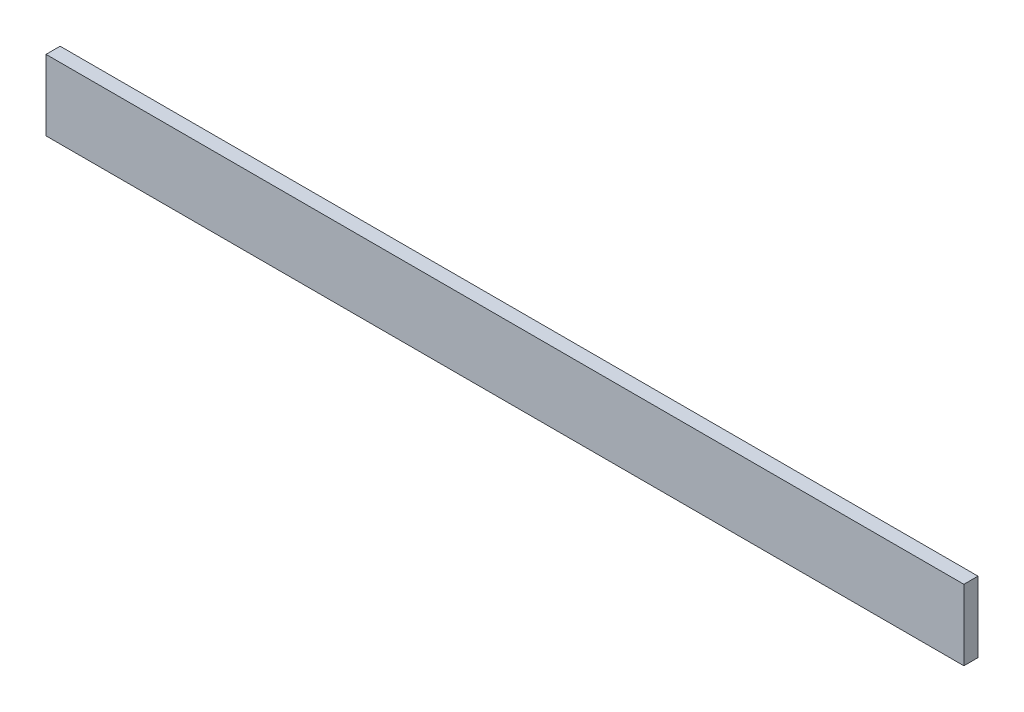
ISO-10303-21;
HEADER;
FILE_DESCRIPTION(('STEP AP214'),'2;1');
FILE_NAME('part.step','',(''),(''),'','','');
FILE_SCHEMA(('AUTOMOTIVE_DESIGN { 1 0 10303 214 1 1 1 1 }'));
ENDSEC;
DATA;
#1=APPLICATION_CONTEXT('core data for automotive mechanical design processes');
#2=APPLICATION_PROTOCOL_DEFINITION('international standard','automotive_design',2000,#1);
#3=PRODUCT_CONTEXT('',#1,'mechanical');
#4=PRODUCT('Part','Part','',(#3));
#5=PRODUCT_RELATED_PRODUCT_CATEGORY('part','',(#4));
#6=PRODUCT_DEFINITION_FORMATION('','',#4);
#7=PRODUCT_DEFINITION_CONTEXT('part definition',#1,'design');
#8=PRODUCT_DEFINITION('design','',#6,#7);
#9=PRODUCT_DEFINITION_SHAPE('','',#8);
#10=(LENGTH_UNIT() NAMED_UNIT(*) SI_UNIT(.MILLI.,.METRE.));
#11=(NAMED_UNIT(*) PLANE_ANGLE_UNIT() SI_UNIT($,.RADIAN.));
#12=(NAMED_UNIT(*) SI_UNIT($,.STERADIAN.) SOLID_ANGLE_UNIT());
#13=UNCERTAINTY_MEASURE_WITH_UNIT(LENGTH_MEASURE(1.E-05),#10,'distance_accuracy_value','');
#14=(GEOMETRIC_REPRESENTATION_CONTEXT(3) GLOBAL_UNCERTAINTY_ASSIGNED_CONTEXT((#13)) GLOBAL_UNIT_ASSIGNED_CONTEXT((#10,
#11,#12)) REPRESENTATION_CONTEXT('',''));
#15=CARTESIAN_POINT('',(0.,0.,0.));
#16=DIRECTION('',(0.,0.,1.));
#17=DIRECTION('',(1.,0.,0.));
#18=AXIS2_PLACEMENT_3D('',#15,#16,#17);
#19=CARTESIAN_POINT('',(650.,0.,0.));
#20=DIRECTION('',(0.,0.,-1.));
#21=DIRECTION('',(-1.,0.,0.));
#22=AXIS2_PLACEMENT_3D('',#19,#20,#21);
#23=PLANE('',#22);
#24=DIRECTION('',(0.,-1.,0.));
#25=VECTOR('',#24,1.);
#26=CARTESIAN_POINT('',(0.,0.,0.));
#27=LINE('',#26,#25);
#28=CARTESIAN_POINT('',(0.,50.,0.));
#29=VERTEX_POINT('',#28);
#30=CARTESIAN_POINT('',(0.,0.,0.));
#31=VERTEX_POINT('',#30);
#32=EDGE_CURVE('E100',#29,#31,#27,.T.);
#33=ORIENTED_EDGE('',*,*,#32,.T.);
#34=DIRECTION('',(-1.,0.,0.));
#35=VECTOR('',#34,1.);
#36=CARTESIAN_POINT('',(650.,0.,0.));
#37=LINE('',#36,#35);
#38=CARTESIAN_POINT('',(650.,0.,0.));
#39=VERTEX_POINT('',#38);
#40=EDGE_CURVE('E11',#39,#31,#37,.T.);
#41=ORIENTED_EDGE('',*,*,#40,.F.);
#42=DIRECTION('',(0.,-1.,0.));
#43=VECTOR('',#42,1.);
#44=CARTESIAN_POINT('',(650.,0.,0.));
#45=LINE('',#44,#43);
#46=CARTESIAN_POINT('',(650.,50.,0.));
#47=VERTEX_POINT('',#46);
#48=EDGE_CURVE('E88',#47,#39,#45,.T.);
#49=ORIENTED_EDGE('',*,*,#48,.F.);
#50=DIRECTION('',(-1.,0.,0.));
#51=VECTOR('',#50,1.);
#52=CARTESIAN_POINT('',(650.,50.,0.));
#53=LINE('',#52,#51);
#54=EDGE_CURVE('E96',#47,#29,#53,.T.);
#55=ORIENTED_EDGE('',*,*,#54,.T.);
#56=EDGE_LOOP('',(#33,#41,#49,#55));
#57=FACE_BOUND('',#56,.T.);
#58=ADVANCED_FACE('F37',(#57),#23,.F.);
#59=CARTESIAN_POINT('',(650.,0.,0.));
#60=DIRECTION('',(0.,1.,0.));
#61=DIRECTION('',(0.,0.,1.));
#62=AXIS2_PLACEMENT_3D('',#59,#60,#61);
#63=PLANE('',#62);
#64=DIRECTION('',(0.,0.,-1.));
#65=VECTOR('',#64,1.);
#66=CARTESIAN_POINT('',(0.,0.,0.));
#67=LINE('',#66,#65);
#68=CARTESIAN_POINT('',(0.,0.,-10.));
#69=VERTEX_POINT('',#68);
#70=EDGE_CURVE('E92',#31,#69,#67,.T.);
#71=ORIENTED_EDGE('',*,*,#70,.T.);
#72=DIRECTION('',(-1.,0.,0.));
#73=VECTOR('',#72,1.);
#74=CARTESIAN_POINT('',(650.,0.,-10.));
#75=LINE('',#74,#73);
#76=CARTESIAN_POINT('',(650.,0.,-10.));
#77=VERTEX_POINT('',#76);
#78=EDGE_CURVE('E45',#77,#69,#75,.T.);
#79=ORIENTED_EDGE('',*,*,#78,.F.);
#80=DIRECTION('',(0.,0.,-1.));
#81=VECTOR('',#80,1.);
#82=CARTESIAN_POINT('',(650.,0.,0.));
#83=LINE('',#82,#81);
#84=EDGE_CURVE('E83',#39,#77,#83,.T.);
#85=ORIENTED_EDGE('',*,*,#84,.F.);
#86=ORIENTED_EDGE('',*,*,#40,.T.);
#87=EDGE_LOOP('',(#71,#79,#85,#86));
#88=FACE_BOUND('',#87,.T.);
#89=ADVANCED_FACE('F91',(#88),#63,.F.);
#90=CARTESIAN_POINT('',(650.,0.,-10.));
#91=DIRECTION('',(0.,0.,1.));
#92=DIRECTION('',(1.,0.,0.));
#93=AXIS2_PLACEMENT_3D('',#90,#91,#92);
#94=PLANE('',#93);
#95=DIRECTION('',(0.,1.,0.));
#96=VECTOR('',#95,1.);
#97=CARTESIAN_POINT('',(0.,0.,-10.));
#98=LINE('',#97,#96);
#99=CARTESIAN_POINT('',(0.,50.,-10.));
#100=VERTEX_POINT('',#99);
#101=EDGE_CURVE('E70',#69,#100,#98,.T.);
#102=ORIENTED_EDGE('',*,*,#101,.T.);
#103=DIRECTION('',(-1.,0.,0.));
#104=VECTOR('',#103,1.);
#105=CARTESIAN_POINT('',(650.,50.,-10.));
#106=LINE('',#105,#104);
#107=CARTESIAN_POINT('',(650.,50.,-10.));
#108=VERTEX_POINT('',#107);
#109=EDGE_CURVE('E93',#108,#100,#106,.T.);
#110=ORIENTED_EDGE('',*,*,#109,.F.);
#111=DIRECTION('',(0.,1.,0.));
#112=VECTOR('',#111,1.);
#113=CARTESIAN_POINT('',(650.,0.,-10.));
#114=LINE('',#113,#112);
#115=EDGE_CURVE('E86',#77,#108,#114,.T.);
#116=ORIENTED_EDGE('',*,*,#115,.F.);
#117=ORIENTED_EDGE('',*,*,#78,.T.);
#118=EDGE_LOOP('',(#102,#110,#116,#117));
#119=FACE_BOUND('',#118,.T.);
#120=ADVANCED_FACE('F94',(#119),#94,.F.);
#121=CARTESIAN_POINT('',(650.,50.,0.));
#122=DIRECTION('',(0.,-1.,0.));
#123=DIRECTION('',(0.,0.,-1.));
#124=AXIS2_PLACEMENT_3D('',#121,#122,#123);
#125=PLANE('',#124);
#126=DIRECTION('',(0.,0.,1.));
#127=VECTOR('',#126,1.);
#128=CARTESIAN_POINT('',(0.,50.,0.));
#129=LINE('',#128,#127);
#130=EDGE_CURVE('E76',#100,#29,#129,.T.);
#131=ORIENTED_EDGE('',*,*,#130,.T.);
#132=ORIENTED_EDGE('',*,*,#54,.F.);
#133=DIRECTION('',(0.,0.,1.));
#134=VECTOR('',#133,1.);
#135=CARTESIAN_POINT('',(650.,50.,0.));
#136=LINE('',#135,#134);
#137=EDGE_CURVE('E53',#108,#47,#136,.T.);
#138=ORIENTED_EDGE('',*,*,#137,.F.);
#139=ORIENTED_EDGE('',*,*,#109,.T.);
#140=EDGE_LOOP('',(#131,#132,#138,#139));
#141=FACE_BOUND('',#140,.T.);
#142=ADVANCED_FACE('F107',(#141),#125,.F.);
#143=CARTESIAN_POINT('',(650.,0.,0.));
#144=DIRECTION('',(-1.,0.,0.));
#145=DIRECTION('',(0.,0.,1.));
#146=AXIS2_PLACEMENT_3D('',#143,#144,#145);
#147=PLANE('',#146);
#148=ORIENTED_EDGE('',*,*,#48,.T.);
#149=ORIENTED_EDGE('',*,*,#84,.T.);
#150=ORIENTED_EDGE('',*,*,#115,.T.);
#151=ORIENTED_EDGE('',*,*,#137,.T.);
#152=EDGE_LOOP('',(#148,#149,#150,#151));
#153=FACE_BOUND('',#152,.T.);
#154=ADVANCED_FACE('F84',(#153),#147,.F.);
#155=CARTESIAN_POINT('',(0.,0.,0.));
#156=DIRECTION('',(-1.,0.,0.));
#157=DIRECTION('',(0.,0.,1.));
#158=AXIS2_PLACEMENT_3D('',#155,#156,#157);
#159=PLANE('',#158);
#160=ORIENTED_EDGE('',*,*,#32,.F.);
#161=ORIENTED_EDGE('',*,*,#130,.F.);
#162=ORIENTED_EDGE('',*,*,#101,.F.);
#163=ORIENTED_EDGE('',*,*,#70,.F.);
#164=EDGE_LOOP('',(#160,#161,#162,#163));
#165=FACE_BOUND('',#164,.T.);
#166=ADVANCED_FACE('F110',(#165),#159,.T.);
#167=CLOSED_SHELL('',(#58,#89,#120,#142,#154,#166));
#168=MANIFOLD_SOLID_BREP('B2',#167);
#169=ADVANCED_BREP_SHAPE_REPRESENTATION('',(#18,#168),#14);
#170=SHAPE_DEFINITION_REPRESENTATION(#9,#169);
ENDSEC;
END-ISO-10303-21;
